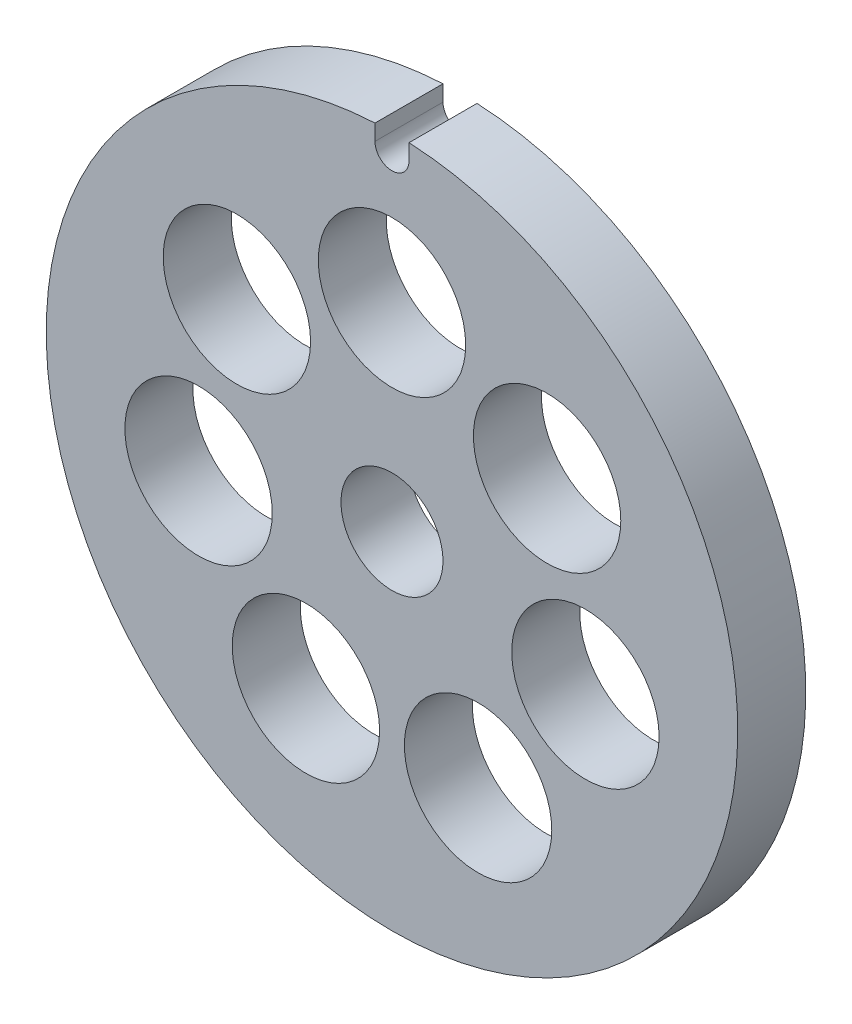
ISO-10303-21;
HEADER;
FILE_DESCRIPTION(('STEP AP214'),'2;1');
FILE_NAME('part.step','',(''),(''),'','','');
FILE_SCHEMA(('AUTOMOTIVE_DESIGN { 1 0 10303 214 1 1 1 1 }'));
ENDSEC;
DATA;
#1=APPLICATION_CONTEXT('core data for automotive mechanical design processes');
#2=APPLICATION_PROTOCOL_DEFINITION('international standard','automotive_design',2000,#1);
#3=PRODUCT_CONTEXT('',#1,'mechanical');
#4=PRODUCT('Part','Part','',(#3));
#5=PRODUCT_RELATED_PRODUCT_CATEGORY('part','',(#4));
#6=PRODUCT_DEFINITION_FORMATION('','',#4);
#7=PRODUCT_DEFINITION_CONTEXT('part definition',#1,'design');
#8=PRODUCT_DEFINITION('design','',#6,#7);
#9=PRODUCT_DEFINITION_SHAPE('','',#8);
#10=(LENGTH_UNIT() NAMED_UNIT(*) SI_UNIT(.MILLI.,.METRE.));
#11=(NAMED_UNIT(*) PLANE_ANGLE_UNIT() SI_UNIT($,.RADIAN.));
#12=(NAMED_UNIT(*) SI_UNIT($,.STERADIAN.) SOLID_ANGLE_UNIT());
#13=UNCERTAINTY_MEASURE_WITH_UNIT(LENGTH_MEASURE(1.E-05),#10,'distance_accuracy_value','');
#14=(GEOMETRIC_REPRESENTATION_CONTEXT(3) GLOBAL_UNCERTAINTY_ASSIGNED_CONTEXT((#13)) GLOBAL_UNIT_ASSIGNED_CONTEXT((#10,
#11,#12)) REPRESENTATION_CONTEXT('',''));
#15=CARTESIAN_POINT('',(0.,0.,0.));
#16=DIRECTION('',(0.,0.,1.));
#17=DIRECTION('',(1.,0.,0.));
#18=AXIS2_PLACEMENT_3D('',#15,#16,#17);
#19=CARTESIAN_POINT('',(0.,29.0630924234556,6.));
#20=DIRECTION('',(0.,0.,1.));
#21=DIRECTION('',(1.,0.,0.));
#22=AXIS2_PLACEMENT_3D('',#19,#20,#21);
#23=PLANE('',#22);
#24=CARTESIAN_POINT('',(-17.0612384631819,-3.89411634423551,6.));
#25=DIRECTION('',(0.,0.,1.));
#26=DIRECTION('',(1.,0.,0.));
#27=AXIS2_PLACEMENT_3D('',#24,#25,#26);
#28=CIRCLE('',#27,6.5);
#29=CARTESIAN_POINT('',(-10.5612384631819,-3.89411634423551,6.));
#30=VERTEX_POINT('',#29);
#31=EDGE_CURVE('E174',#30,#30,#28,.T.);
#32=ORIENTED_EDGE('',*,*,#31,.F.);
#33=EDGE_LOOP('',(#32));
#34=FACE_BOUND('',#33,.T.);
#35=CARTESIAN_POINT('',(7.59296543455727,-15.7669551882923,6.));
#36=DIRECTION('',(0.,0.,1.));
#37=DIRECTION('',(1.,0.,0.));
#38=AXIS2_PLACEMENT_3D('',#35,#36,#37);
#39=CIRCLE('',#38,6.5);
#40=CARTESIAN_POINT('',(14.0929654345573,-15.7669551882923,6.));
#41=VERTEX_POINT('',#40);
#42=EDGE_CURVE('E158',#41,#41,#39,.T.);
#43=ORIENTED_EDGE('',*,*,#42,.F.);
#44=EDGE_LOOP('',(#43));
#45=FACE_BOUND('',#44,.T.);
#46=CARTESIAN_POINT('',(13.6820509431905,10.9110715325278,6.));
#47=DIRECTION('',(0.,0.,1.));
#48=DIRECTION('',(1.,0.,0.));
#49=AXIS2_PLACEMENT_3D('',#46,#47,#48);
#50=CIRCLE('',#49,6.50000000000001);
#51=CARTESIAN_POINT('',(20.1820509431905,10.9110715325278,6.));
#52=VERTEX_POINT('',#51);
#53=EDGE_CURVE('E142',#52,#52,#50,.T.);
#54=ORIENTED_EDGE('',*,*,#53,.F.);
#55=EDGE_LOOP('',(#54));
#56=FACE_BOUND('',#55,.T.);
#57=CARTESIAN_POINT('',(0.,0.,6.));
#58=DIRECTION('',(0.,0.,1.));
#59=DIRECTION('',(1.,0.,0.));
#60=AXIS2_PLACEMENT_3D('',#57,#58,#59);
#61=CIRCLE('',#60,4.5);
#62=CARTESIAN_POINT('',(4.5,0.,6.));
#63=VERTEX_POINT('',#62);
#64=EDGE_CURVE('E112',#63,#63,#61,.T.);
#65=ORIENTED_EDGE('',*,*,#64,.F.);
#66=EDGE_LOOP('',(#65));
#67=FACE_BOUND('',#66,.T.);
#68=CARTESIAN_POINT('',(0.,29.0630924234556,6.));
#69=DIRECTION('',(0.,0.,-1.));
#70=DIRECTION('',(1.,0.,0.));
#71=AXIS2_PLACEMENT_3D('',#68,#69,#70);
#72=CIRCLE('',#71,1.5);
#73=CARTESIAN_POINT('',(1.5,29.0630924234556,6.));
#74=VERTEX_POINT('',#73);
#75=CARTESIAN_POINT('',(-1.5,29.0630924234556,6.));
#76=VERTEX_POINT('',#75);
#77=EDGE_CURVE('E92',#74,#76,#72,.T.);
#78=ORIENTED_EDGE('',*,*,#77,.T.);
#79=DIRECTION('',(0.,1.,0.));
#80=VECTOR('',#79,1.);
#81=CARTESIAN_POINT('',(-1.5,29.0630924234556,6.));
#82=LINE('',#81,#80);
#83=CARTESIAN_POINT('',(-1.5,30.4630924234556,6.));
#84=VERTEX_POINT('',#83);
#85=EDGE_CURVE('E87',#76,#84,#82,.T.);
#86=ORIENTED_EDGE('',*,*,#85,.T.);
#87=CARTESIAN_POINT('',(0.,0.,6.));
#88=DIRECTION('',(0.,0.,1.));
#89=DIRECTION('',(1.,0.,0.));
#90=AXIS2_PLACEMENT_3D('',#87,#88,#89);
#91=CIRCLE('',#90,30.5);
#92=CARTESIAN_POINT('',(1.5,30.4630924234556,6.));
#93=VERTEX_POINT('',#92);
#94=EDGE_CURVE('E90',#84,#93,#91,.T.);
#95=ORIENTED_EDGE('',*,*,#94,.T.);
#96=DIRECTION('',(0.,-1.,0.));
#97=VECTOR('',#96,1.);
#98=CARTESIAN_POINT('',(1.5,29.0630924234556,6.));
#99=LINE('',#98,#97);
#100=EDGE_CURVE('E57',#93,#74,#99,.T.);
#101=ORIENTED_EDGE('',*,*,#100,.T.);
#102=EDGE_LOOP('',(#78,#86,#95,#101));
#103=FACE_BOUND('',#102,.T.);
#104=CARTESIAN_POINT('',(0.,17.5,6.));
#105=DIRECTION('',(0.,0.,1.));
#106=DIRECTION('',(1.,0.,0.));
#107=AXIS2_PLACEMENT_3D('',#104,#105,#106);
#108=CIRCLE('',#107,6.5);
#109=CARTESIAN_POINT('',(6.5,17.5,6.));
#110=VERTEX_POINT('',#109);
#111=EDGE_CURVE('E134',#110,#110,#108,.T.);
#112=ORIENTED_EDGE('',*,*,#111,.F.);
#113=EDGE_LOOP('',(#112));
#114=FACE_BOUND('',#113,.T.);
#115=CARTESIAN_POINT('',(17.0612384631819,-3.8941163442355,6.));
#116=DIRECTION('',(0.,0.,1.));
#117=DIRECTION('',(1.,0.,0.));
#118=AXIS2_PLACEMENT_3D('',#115,#116,#117);
#119=CIRCLE('',#118,6.5);
#120=CARTESIAN_POINT('',(23.5612384631819,-3.8941163442355,6.));
#121=VERTEX_POINT('',#120);
#122=EDGE_CURVE('E150',#121,#121,#119,.T.);
#123=ORIENTED_EDGE('',*,*,#122,.F.);
#124=EDGE_LOOP('',(#123));
#125=FACE_BOUND('',#124,.T.);
#126=CARTESIAN_POINT('',(-7.59296543455727,-15.7669551882923,6.));
#127=DIRECTION('',(0.,0.,1.));
#128=DIRECTION('',(1.,0.,0.));
#129=AXIS2_PLACEMENT_3D('',#126,#127,#128);
#130=CIRCLE('',#129,6.5);
#131=CARTESIAN_POINT('',(-1.09296543455727,-15.7669551882923,6.));
#132=VERTEX_POINT('',#131);
#133=EDGE_CURVE('E166',#132,#132,#130,.T.);
#134=ORIENTED_EDGE('',*,*,#133,.F.);
#135=EDGE_LOOP('',(#134));
#136=FACE_BOUND('',#135,.T.);
#137=CARTESIAN_POINT('',(-13.6820509431905,10.9110715325278,6.));
#138=DIRECTION('',(0.,0.,1.));
#139=DIRECTION('',(1.,0.,0.));
#140=AXIS2_PLACEMENT_3D('',#137,#138,#139);
#141=CIRCLE('',#140,6.5);
#142=CARTESIAN_POINT('',(-7.18205094319052,10.9110715325278,6.));
#143=VERTEX_POINT('',#142);
#144=EDGE_CURVE('E182',#143,#143,#141,.T.);
#145=ORIENTED_EDGE('',*,*,#144,.F.);
#146=EDGE_LOOP('',(#145));
#147=FACE_BOUND('',#146,.T.);
#148=ADVANCED_FACE('F39',(#34,#45,#56,#67,#103,#114,#125,#136,#147),#23,.T.);
#149=CARTESIAN_POINT('',(0.,29.0630924234556,0.));
#150=DIRECTION('',(0.,0.,1.));
#151=DIRECTION('',(1.,0.,0.));
#152=AXIS2_PLACEMENT_3D('',#149,#150,#151);
#153=PLANE('',#152);
#154=CARTESIAN_POINT('',(0.,29.0630924234556,0.));
#155=DIRECTION('',(0.,0.,-1.));
#156=DIRECTION('',(1.,0.,0.));
#157=AXIS2_PLACEMENT_3D('',#154,#155,#156);
#158=CIRCLE('',#157,1.5);
#159=CARTESIAN_POINT('',(1.5,29.0630924234556,0.));
#160=VERTEX_POINT('',#159);
#161=CARTESIAN_POINT('',(-1.5,29.0630924234556,0.));
#162=VERTEX_POINT('',#161);
#163=EDGE_CURVE('E108',#160,#162,#158,.T.);
#164=ORIENTED_EDGE('',*,*,#163,.F.);
#165=DIRECTION('',(0.,-1.,0.));
#166=VECTOR('',#165,1.);
#167=CARTESIAN_POINT('',(1.5,29.0630924234556,0.));
#168=LINE('',#167,#166);
#169=CARTESIAN_POINT('',(1.5,30.4630924234556,0.));
#170=VERTEX_POINT('',#169);
#171=EDGE_CURVE('E80',#170,#160,#168,.T.);
#172=ORIENTED_EDGE('',*,*,#171,.F.);
#173=CARTESIAN_POINT('',(0.,0.,0.));
#174=DIRECTION('',(0.,0.,1.));
#175=DIRECTION('',(1.,0.,0.));
#176=AXIS2_PLACEMENT_3D('',#173,#174,#175);
#177=CIRCLE('',#176,30.5);
#178=CARTESIAN_POINT('',(-1.5,30.4630924234556,0.));
#179=VERTEX_POINT('',#178);
#180=EDGE_CURVE('E74',#179,#170,#177,.T.);
#181=ORIENTED_EDGE('',*,*,#180,.F.);
#182=DIRECTION('',(0.,1.,0.));
#183=VECTOR('',#182,1.);
#184=CARTESIAN_POINT('',(-1.5,29.0630924234556,0.));
#185=LINE('',#184,#183);
#186=EDGE_CURVE('E97',#162,#179,#185,.T.);
#187=ORIENTED_EDGE('',*,*,#186,.F.);
#188=EDGE_LOOP('',(#164,#172,#181,#187));
#189=FACE_BOUND('',#188,.T.);
#190=CARTESIAN_POINT('',(0.,0.,0.));
#191=DIRECTION('',(0.,0.,1.));
#192=DIRECTION('',(1.,0.,0.));
#193=AXIS2_PLACEMENT_3D('',#190,#191,#192);
#194=CIRCLE('',#193,4.5);
#195=CARTESIAN_POINT('',(4.5,0.,0.));
#196=VERTEX_POINT('',#195);
#197=EDGE_CURVE('E130',#196,#196,#194,.T.);
#198=ORIENTED_EDGE('',*,*,#197,.T.);
#199=EDGE_LOOP('',(#198));
#200=FACE_BOUND('',#199,.T.);
#201=CARTESIAN_POINT('',(0.,17.5,0.));
#202=DIRECTION('',(0.,0.,1.));
#203=DIRECTION('',(1.,0.,0.));
#204=AXIS2_PLACEMENT_3D('',#201,#202,#203);
#205=CIRCLE('',#204,6.5);
#206=CARTESIAN_POINT('',(6.5,17.5,0.));
#207=VERTEX_POINT('',#206);
#208=EDGE_CURVE('E138',#207,#207,#205,.T.);
#209=ORIENTED_EDGE('',*,*,#208,.T.);
#210=EDGE_LOOP('',(#209));
#211=FACE_BOUND('',#210,.T.);
#212=CARTESIAN_POINT('',(13.6820509431905,10.9110715325278,0.));
#213=DIRECTION('',(0.,0.,1.));
#214=DIRECTION('',(1.,0.,0.));
#215=AXIS2_PLACEMENT_3D('',#212,#213,#214);
#216=CIRCLE('',#215,6.50000000000001);
#217=CARTESIAN_POINT('',(20.1820509431905,10.9110715325278,0.));
#218=VERTEX_POINT('',#217);
#219=EDGE_CURVE('E146',#218,#218,#216,.T.);
#220=ORIENTED_EDGE('',*,*,#219,.T.);
#221=EDGE_LOOP('',(#220));
#222=FACE_BOUND('',#221,.T.);
#223=CARTESIAN_POINT('',(17.0612384631819,-3.8941163442355,0.));
#224=DIRECTION('',(0.,0.,1.));
#225=DIRECTION('',(1.,0.,0.));
#226=AXIS2_PLACEMENT_3D('',#223,#224,#225);
#227=CIRCLE('',#226,6.5);
#228=CARTESIAN_POINT('',(23.5612384631819,-3.8941163442355,0.));
#229=VERTEX_POINT('',#228);
#230=EDGE_CURVE('E154',#229,#229,#227,.T.);
#231=ORIENTED_EDGE('',*,*,#230,.T.);
#232=EDGE_LOOP('',(#231));
#233=FACE_BOUND('',#232,.T.);
#234=CARTESIAN_POINT('',(7.59296543455727,-15.7669551882923,0.));
#235=DIRECTION('',(0.,0.,1.));
#236=DIRECTION('',(1.,0.,0.));
#237=AXIS2_PLACEMENT_3D('',#234,#235,#236);
#238=CIRCLE('',#237,6.5);
#239=CARTESIAN_POINT('',(14.0929654345573,-15.7669551882923,0.));
#240=VERTEX_POINT('',#239);
#241=EDGE_CURVE('E162',#240,#240,#238,.T.);
#242=ORIENTED_EDGE('',*,*,#241,.T.);
#243=EDGE_LOOP('',(#242));
#244=FACE_BOUND('',#243,.T.);
#245=CARTESIAN_POINT('',(-7.59296543455727,-15.7669551882923,0.));
#246=DIRECTION('',(0.,0.,1.));
#247=DIRECTION('',(1.,0.,0.));
#248=AXIS2_PLACEMENT_3D('',#245,#246,#247);
#249=CIRCLE('',#248,6.5);
#250=CARTESIAN_POINT('',(-1.09296543455727,-15.7669551882923,0.));
#251=VERTEX_POINT('',#250);
#252=EDGE_CURVE('E170',#251,#251,#249,.T.);
#253=ORIENTED_EDGE('',*,*,#252,.T.);
#254=EDGE_LOOP('',(#253));
#255=FACE_BOUND('',#254,.T.);
#256=CARTESIAN_POINT('',(-17.0612384631819,-3.89411634423551,0.));
#257=DIRECTION('',(0.,0.,1.));
#258=DIRECTION('',(1.,0.,0.));
#259=AXIS2_PLACEMENT_3D('',#256,#257,#258);
#260=CIRCLE('',#259,6.5);
#261=CARTESIAN_POINT('',(-10.5612384631819,-3.89411634423551,0.));
#262=VERTEX_POINT('',#261);
#263=EDGE_CURVE('E178',#262,#262,#260,.T.);
#264=ORIENTED_EDGE('',*,*,#263,.T.);
#265=EDGE_LOOP('',(#264));
#266=FACE_BOUND('',#265,.T.);
#267=CARTESIAN_POINT('',(-13.6820509431905,10.9110715325278,0.));
#268=DIRECTION('',(0.,0.,1.));
#269=DIRECTION('',(1.,0.,0.));
#270=AXIS2_PLACEMENT_3D('',#267,#268,#269);
#271=CIRCLE('',#270,6.5);
#272=CARTESIAN_POINT('',(-7.18205094319052,10.9110715325278,0.));
#273=VERTEX_POINT('',#272);
#274=EDGE_CURVE('E186',#273,#273,#271,.T.);
#275=ORIENTED_EDGE('',*,*,#274,.T.);
#276=EDGE_LOOP('',(#275));
#277=FACE_BOUND('',#276,.T.);
#278=ADVANCED_FACE('F125',(#189,#200,#211,#222,#233,#244,#255,#266,#277),#153,.F.);
#279=CARTESIAN_POINT('',(0.,29.0630924234556,6.));
#280=DIRECTION('',(0.,0.,-1.));
#281=DIRECTION('',(-1.,0.,0.));
#282=AXIS2_PLACEMENT_3D('',#279,#280,#281);
#283=CYLINDRICAL_SURFACE('',#282,1.5);
#284=ORIENTED_EDGE('',*,*,#163,.T.);
#285=DIRECTION('',(0.,0.,-1.));
#286=VECTOR('',#285,1.);
#287=CARTESIAN_POINT('',(-1.5,29.0630924234556,6.));
#288=LINE('',#287,#286);
#289=EDGE_CURVE('E11',#76,#162,#288,.T.);
#290=ORIENTED_EDGE('',*,*,#289,.F.);
#291=ORIENTED_EDGE('',*,*,#77,.F.);
#292=DIRECTION('',(0.,0.,-1.));
#293=VECTOR('',#292,1.);
#294=CARTESIAN_POINT('',(1.5,29.0630924234556,6.));
#295=LINE('',#294,#293);
#296=EDGE_CURVE('E104',#74,#160,#295,.T.);
#297=ORIENTED_EDGE('',*,*,#296,.T.);
#298=EDGE_LOOP('',(#284,#290,#291,#297));
#299=FACE_BOUND('',#298,.T.);
#300=ADVANCED_FACE('F41',(#299),#283,.F.);
#301=CARTESIAN_POINT('',(-1.5,29.0630924234556,6.));
#302=DIRECTION('',(-1.,0.,0.));
#303=DIRECTION('',(0.,0.,1.));
#304=AXIS2_PLACEMENT_3D('',#301,#302,#303);
#305=PLANE('',#304);
#306=ORIENTED_EDGE('',*,*,#186,.T.);
#307=DIRECTION('',(0.,0.,-1.));
#308=VECTOR('',#307,1.);
#309=CARTESIAN_POINT('',(-1.5,30.4630924234556,6.));
#310=LINE('',#309,#308);
#311=EDGE_CURVE('E49',#84,#179,#310,.T.);
#312=ORIENTED_EDGE('',*,*,#311,.F.);
#313=ORIENTED_EDGE('',*,*,#85,.F.);
#314=ORIENTED_EDGE('',*,*,#289,.T.);
#315=EDGE_LOOP('',(#306,#312,#313,#314));
#316=FACE_BOUND('',#315,.T.);
#317=ADVANCED_FACE('F96',(#316),#305,.F.);
#318=CARTESIAN_POINT('',(0.,0.,6.));
#319=DIRECTION('',(0.,0.,-1.));
#320=DIRECTION('',(-1.,0.,0.));
#321=AXIS2_PLACEMENT_3D('',#318,#319,#320);
#322=CYLINDRICAL_SURFACE('',#321,30.5);
#323=ORIENTED_EDGE('',*,*,#180,.T.);
#324=DIRECTION('',(0.,0.,-1.));
#325=VECTOR('',#324,1.);
#326=CARTESIAN_POINT('',(1.5,30.4630924234556,6.));
#327=LINE('',#326,#325);
#328=EDGE_CURVE('E99',#93,#170,#327,.T.);
#329=ORIENTED_EDGE('',*,*,#328,.F.);
#330=ORIENTED_EDGE('',*,*,#94,.F.);
#331=ORIENTED_EDGE('',*,*,#311,.T.);
#332=EDGE_LOOP('',(#323,#329,#330,#331));
#333=FACE_BOUND('',#332,.T.);
#334=ADVANCED_FACE('F100',(#333),#322,.T.);
#335=CARTESIAN_POINT('',(1.5,29.0630924234556,6.));
#336=DIRECTION('',(1.,0.,0.));
#337=DIRECTION('',(0.,1.,0.));
#338=AXIS2_PLACEMENT_3D('',#335,#336,#337);
#339=PLANE('',#338);
#340=ORIENTED_EDGE('',*,*,#171,.T.);
#341=ORIENTED_EDGE('',*,*,#296,.F.);
#342=ORIENTED_EDGE('',*,*,#100,.F.);
#343=ORIENTED_EDGE('',*,*,#328,.T.);
#344=EDGE_LOOP('',(#340,#341,#342,#343));
#345=FACE_BOUND('',#344,.T.);
#346=ADVANCED_FACE('F122',(#345),#339,.F.);
#347=CARTESIAN_POINT('',(0.,0.,6.));
#348=DIRECTION('',(0.,0.,-1.));
#349=DIRECTION('',(-1.,0.,0.));
#350=AXIS2_PLACEMENT_3D('',#347,#348,#349);
#351=CYLINDRICAL_SURFACE('',#350,4.5);
#352=ORIENTED_EDGE('',*,*,#64,.T.);
#353=EDGE_LOOP('',(#352));
#354=FACE_BOUND('',#353,.T.);
#355=ORIENTED_EDGE('',*,*,#197,.F.);
#356=EDGE_LOOP('',(#355));
#357=FACE_BOUND('',#356,.T.);
#358=ADVANCED_FACE('F207',(#354,#357),#351,.F.);
#359=CARTESIAN_POINT('',(0.,17.5,6.));
#360=DIRECTION('',(0.,0.,-1.));
#361=DIRECTION('',(-1.,0.,0.));
#362=AXIS2_PLACEMENT_3D('',#359,#360,#361);
#363=CYLINDRICAL_SURFACE('',#362,6.5);
#364=ORIENTED_EDGE('',*,*,#111,.T.);
#365=EDGE_LOOP('',(#364));
#366=FACE_BOUND('',#365,.T.);
#367=ORIENTED_EDGE('',*,*,#208,.F.);
#368=EDGE_LOOP('',(#367));
#369=FACE_BOUND('',#368,.T.);
#370=ADVANCED_FACE('F253',(#366,#369),#363,.F.);
#371=CARTESIAN_POINT('',(13.6820509431905,10.9110715325278,6.));
#372=DIRECTION('',(0.,0.,-1.));
#373=DIRECTION('',(-1.,0.,0.));
#374=AXIS2_PLACEMENT_3D('',#371,#372,#373);
#375=CYLINDRICAL_SURFACE('',#374,6.50000000000001);
#376=ORIENTED_EDGE('',*,*,#53,.T.);
#377=EDGE_LOOP('',(#376));
#378=FACE_BOUND('',#377,.T.);
#379=ORIENTED_EDGE('',*,*,#219,.F.);
#380=EDGE_LOOP('',(#379));
#381=FACE_BOUND('',#380,.T.);
#382=ADVANCED_FACE('F261',(#378,#381),#375,.F.);
#383=CARTESIAN_POINT('',(17.0612384631819,-3.8941163442355,6.));
#384=DIRECTION('',(0.,0.,-1.));
#385=DIRECTION('',(-1.,0.,0.));
#386=AXIS2_PLACEMENT_3D('',#383,#384,#385);
#387=CYLINDRICAL_SURFACE('',#386,6.5);
#388=ORIENTED_EDGE('',*,*,#122,.T.);
#389=EDGE_LOOP('',(#388));
#390=FACE_BOUND('',#389,.T.);
#391=ORIENTED_EDGE('',*,*,#230,.F.);
#392=EDGE_LOOP('',(#391));
#393=FACE_BOUND('',#392,.T.);
#394=ADVANCED_FACE('F269',(#390,#393),#387,.F.);
#395=CARTESIAN_POINT('',(7.59296543455727,-15.7669551882923,6.));
#396=DIRECTION('',(0.,0.,-1.));
#397=DIRECTION('',(-1.,0.,0.));
#398=AXIS2_PLACEMENT_3D('',#395,#396,#397);
#399=CYLINDRICAL_SURFACE('',#398,6.5);
#400=ORIENTED_EDGE('',*,*,#42,.T.);
#401=EDGE_LOOP('',(#400));
#402=FACE_BOUND('',#401,.T.);
#403=ORIENTED_EDGE('',*,*,#241,.F.);
#404=EDGE_LOOP('',(#403));
#405=FACE_BOUND('',#404,.T.);
#406=ADVANCED_FACE('F278',(#402,#405),#399,.F.);
#407=CARTESIAN_POINT('',(-7.59296543455727,-15.7669551882923,6.));
#408=DIRECTION('',(0.,0.,-1.));
#409=DIRECTION('',(-1.,0.,0.));
#410=AXIS2_PLACEMENT_3D('',#407,#408,#409);
#411=CYLINDRICAL_SURFACE('',#410,6.5);
#412=ORIENTED_EDGE('',*,*,#133,.T.);
#413=EDGE_LOOP('',(#412));
#414=FACE_BOUND('',#413,.T.);
#415=ORIENTED_EDGE('',*,*,#252,.F.);
#416=EDGE_LOOP('',(#415));
#417=FACE_BOUND('',#416,.T.);
#418=ADVANCED_FACE('F287',(#414,#417),#411,.F.);
#419=CARTESIAN_POINT('',(-17.0612384631819,-3.89411634423551,6.));
#420=DIRECTION('',(0.,0.,-1.));
#421=DIRECTION('',(-1.,0.,0.));
#422=AXIS2_PLACEMENT_3D('',#419,#420,#421);
#423=CYLINDRICAL_SURFACE('',#422,6.5);
#424=ORIENTED_EDGE('',*,*,#31,.T.);
#425=EDGE_LOOP('',(#424));
#426=FACE_BOUND('',#425,.T.);
#427=ORIENTED_EDGE('',*,*,#263,.F.);
#428=EDGE_LOOP('',(#427));
#429=FACE_BOUND('',#428,.T.);
#430=ADVANCED_FACE('F296',(#426,#429),#423,.F.);
#431=CARTESIAN_POINT('',(-13.6820509431905,10.9110715325278,6.));
#432=DIRECTION('',(0.,0.,-1.));
#433=DIRECTION('',(-1.,0.,0.));
#434=AXIS2_PLACEMENT_3D('',#431,#432,#433);
#435=CYLINDRICAL_SURFACE('',#434,6.5);
#436=ORIENTED_EDGE('',*,*,#144,.T.);
#437=EDGE_LOOP('',(#436));
#438=FACE_BOUND('',#437,.T.);
#439=ORIENTED_EDGE('',*,*,#274,.F.);
#440=EDGE_LOOP('',(#439));
#441=FACE_BOUND('',#440,.T.);
#442=ADVANCED_FACE('F194',(#438,#441),#435,.F.);
#443=CLOSED_SHELL('',(#148,#278,#300,#317,#334,#346,#358,#370,#382,#394,#406,#418,#430,#442));
#444=MANIFOLD_SOLID_BREP('B2',#443);
#445=ADVANCED_BREP_SHAPE_REPRESENTATION('',(#18,#444),#14);
#446=SHAPE_DEFINITION_REPRESENTATION(#9,#445);
ENDSEC;
END-ISO-10303-21;
